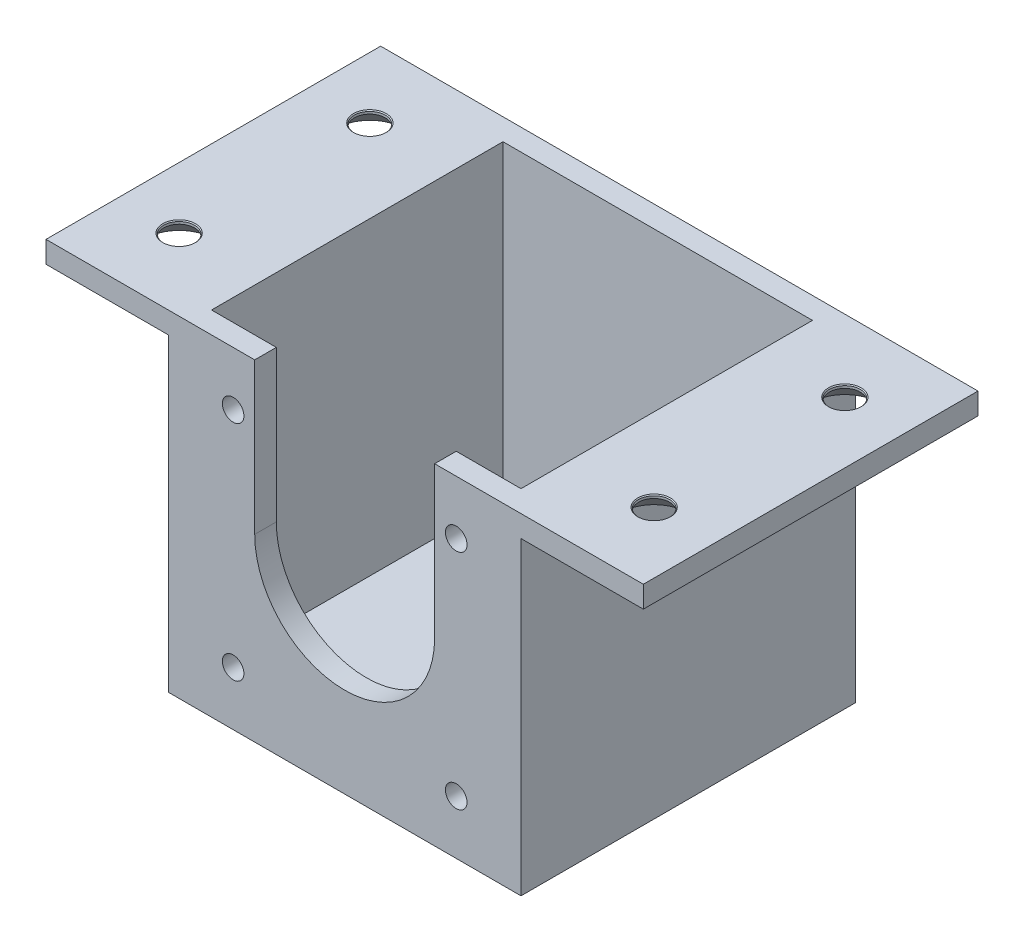
ISO-10303-21;
HEADER;
FILE_DESCRIPTION(('STEP AP214'),'2;1');
FILE_NAME('part.step','',(''),(''),'','','');
FILE_SCHEMA(('AUTOMOTIVE_DESIGN { 1 0 10303 214 1 1 1 1 }'));
ENDSEC;
DATA;
#1=APPLICATION_CONTEXT('core data for automotive mechanical design processes');
#2=APPLICATION_PROTOCOL_DEFINITION('international standard','automotive_design',2000,#1);
#3=PRODUCT_CONTEXT('',#1,'mechanical');
#4=PRODUCT('Part','Part','',(#3));
#5=PRODUCT_RELATED_PRODUCT_CATEGORY('part','',(#4));
#6=PRODUCT_DEFINITION_FORMATION('','',#4);
#7=PRODUCT_DEFINITION_CONTEXT('part definition',#1,'design');
#8=PRODUCT_DEFINITION('design','',#6,#7);
#9=PRODUCT_DEFINITION_SHAPE('','',#8);
#10=(LENGTH_UNIT() NAMED_UNIT(*) SI_UNIT(.MILLI.,.METRE.));
#11=(NAMED_UNIT(*) PLANE_ANGLE_UNIT() SI_UNIT($,.RADIAN.));
#12=(NAMED_UNIT(*) SI_UNIT($,.STERADIAN.) SOLID_ANGLE_UNIT());
#13=UNCERTAINTY_MEASURE_WITH_UNIT(LENGTH_MEASURE(1.E-05),#10,'distance_accuracy_value','');
#14=(GEOMETRIC_REPRESENTATION_CONTEXT(3) GLOBAL_UNCERTAINTY_ASSIGNED_CONTEXT((#13)) GLOBAL_UNIT_ASSIGNED_CONTEXT((#10,
#11,#12)) REPRESENTATION_CONTEXT('',''));
#15=CARTESIAN_POINT('',(0.,0.,0.));
#16=DIRECTION('',(0.,0.,1.));
#17=DIRECTION('',(1.,0.,0.));
#18=AXIS2_PLACEMENT_3D('',#15,#16,#17);
#19=CARTESIAN_POINT('',(-43.,40.,46.5));
#20=DIRECTION('',(0.,1.,0.));
#21=DIRECTION('',(0.,0.,1.));
#22=AXIS2_PLACEMENT_3D('',#19,#20,#21);
#23=PLANE('',#22);
#24=CARTESIAN_POINT('',(-54.5,40.,10.));
#25=DIRECTION('',(0.,-1.,0.));
#26=DIRECTION('',(0.,0.,-1.));
#27=AXIS2_PLACEMENT_3D('',#24,#25,#26);
#28=CIRCLE('',#27,4.7);
#29=CARTESIAN_POINT('',(-54.5,40.,5.3));
#30=VERTEX_POINT('',#29);
#31=EDGE_CURVE('E243',#30,#30,#28,.T.);
#32=ORIENTED_EDGE('',*,*,#31,.F.);
#33=EDGE_LOOP('',(#32));
#34=FACE_BOUND('',#33,.T.);
#35=DIRECTION('',(1.,0.,0.));
#36=VECTOR('',#35,1.);
#37=CARTESIAN_POINT('',(-43.,40.,0.));
#38=LINE('',#37,#36);
#39=CARTESIAN_POINT('',(-63.,40.,0.));
#40=VERTEX_POINT('',#39);
#41=CARTESIAN_POINT('',(-46.,40.,0.));
#42=VERTEX_POINT('',#41);
#43=EDGE_CURVE('E370',#40,#42,#38,.T.);
#44=ORIENTED_EDGE('',*,*,#43,.T.);
#45=DIRECTION('',(0.,0.,-1.));
#46=VECTOR('',#45,1.);
#47=CARTESIAN_POINT('',(-46.,40.,46.5));
#48=LINE('',#47,#46);
#49=CARTESIAN_POINT('',(-46.,40.,46.5));
#50=VERTEX_POINT('',#49);
#51=EDGE_CURVE('E386',#50,#42,#48,.T.);
#52=ORIENTED_EDGE('',*,*,#51,.F.);
#53=DIRECTION('',(1.,0.,0.));
#54=VECTOR('',#53,1.);
#55=CARTESIAN_POINT('',(-43.,40.,46.5));
#56=LINE('',#55,#54);
#57=CARTESIAN_POINT('',(-63.,40.,46.5));
#58=VERTEX_POINT('',#57);
#59=EDGE_CURVE('E351',#58,#50,#56,.T.);
#60=ORIENTED_EDGE('',*,*,#59,.F.);
#61=DIRECTION('',(0.,0.,-1.));
#62=VECTOR('',#61,1.);
#63=CARTESIAN_POINT('',(-63.,40.,46.5));
#64=LINE('',#63,#62);
#65=EDGE_CURVE('E389',#58,#40,#64,.T.);
#66=ORIENTED_EDGE('',*,*,#65,.T.);
#67=EDGE_LOOP('',(#44,#52,#60,#66));
#68=FACE_BOUND('',#67,.T.);
#69=CARTESIAN_POINT('',(-54.5,40.,36.5));
#70=DIRECTION('',(0.,-1.,0.));
#71=DIRECTION('',(0.,0.,-1.));
#72=AXIS2_PLACEMENT_3D('',#69,#70,#71);
#73=CIRCLE('',#72,4.7);
#74=CARTESIAN_POINT('',(-54.5,40.,31.8));
#75=VERTEX_POINT('',#74);
#76=EDGE_CURVE('E255',#75,#75,#73,.T.);
#77=ORIENTED_EDGE('',*,*,#76,.F.);
#78=EDGE_LOOP('',(#77));
#79=FACE_BOUND('',#78,.T.);
#80=ADVANCED_FACE('F35',(#34,#68,#79),#23,.F.);
#81=CARTESIAN_POINT('',(0.,0.,46.5));
#82=DIRECTION('',(-1.,0.,0.));
#83=DIRECTION('',(0.,0.,1.));
#84=AXIS2_PLACEMENT_3D('',#81,#82,#83);
#85=PLANE('',#84);
#86=DIRECTION('',(0.,0.,-1.));
#87=VECTOR('',#86,1.);
#88=CARTESIAN_POINT('',(0.,0.,46.5));
#89=LINE('',#88,#87);
#90=CARTESIAN_POINT('',(0.,0.,43.5));
#91=VERTEX_POINT('',#90);
#92=CARTESIAN_POINT('',(0.,0.,3.));
#93=VERTEX_POINT('',#92);
#94=EDGE_CURVE('E397',#91,#93,#89,.T.);
#95=ORIENTED_EDGE('',*,*,#94,.F.);
#96=DIRECTION('',(0.,-1.,0.));
#97=VECTOR('',#96,1.);
#98=CARTESIAN_POINT('',(0.,43.,43.5));
#99=LINE('',#98,#97);
#100=CARTESIAN_POINT('',(0.,43.,43.5));
#101=VERTEX_POINT('',#100);
#102=EDGE_CURVE('E316',#101,#91,#99,.T.);
#103=ORIENTED_EDGE('',*,*,#102,.F.);
#104=DIRECTION('',(0.,0.,-1.));
#105=VECTOR('',#104,1.);
#106=CARTESIAN_POINT('',(0.,43.,46.5));
#107=LINE('',#106,#105);
#108=CARTESIAN_POINT('',(0.,43.,3.));
#109=VERTEX_POINT('',#108);
#110=EDGE_CURVE('E400',#101,#109,#107,.T.);
#111=ORIENTED_EDGE('',*,*,#110,.T.);
#112=DIRECTION('',(0.,-1.,0.));
#113=VECTOR('',#112,1.);
#114=CARTESIAN_POINT('',(0.,43.,3.));
#115=LINE('',#114,#113);
#116=EDGE_CURVE('E328',#109,#93,#115,.T.);
#117=ORIENTED_EDGE('',*,*,#116,.T.);
#118=EDGE_LOOP('',(#95,#103,#111,#117));
#119=FACE_BOUND('',#118,.T.);
#120=ADVANCED_FACE('F471',(#119),#85,.T.);
#121=CARTESIAN_POINT('',(0.,0.,46.5));
#122=DIRECTION('',(0.,1.,0.));
#123=DIRECTION('',(-1.,0.,0.));
#124=AXIS2_PLACEMENT_3D('',#121,#122,#123);
#125=PLANE('',#124);
#126=DIRECTION('',(0.,0.,-1.));
#127=VECTOR('',#126,1.);
#128=CARTESIAN_POINT('',(-8.99999999999999,0.,46.5));
#129=LINE('',#128,#127);
#130=CARTESIAN_POINT('',(-8.99999999999999,0.,15.));
#131=VERTEX_POINT('',#130);
#132=CARTESIAN_POINT('',(-9.,0.,3.));
#133=VERTEX_POINT('',#132);
#134=EDGE_CURVE('E204',#131,#133,#129,.T.);
#135=ORIENTED_EDGE('',*,*,#134,.F.);
#136=DIRECTION('',(1.,0.,0.));
#137=VECTOR('',#136,1.);
#138=CARTESIAN_POINT('',(0.,0.,15.));
#139=LINE('',#138,#137);
#140=CARTESIAN_POINT('',(-34.,0.,15.));
#141=VERTEX_POINT('',#140);
#142=EDGE_CURVE('E214',#141,#131,#139,.T.);
#143=ORIENTED_EDGE('',*,*,#142,.F.);
#144=DIRECTION('',(0.,0.,1.));
#145=VECTOR('',#144,1.);
#146=CARTESIAN_POINT('',(-34.,0.,46.5));
#147=LINE('',#146,#145);
#148=CARTESIAN_POINT('',(-34.,0.,3.));
#149=VERTEX_POINT('',#148);
#150=EDGE_CURVE('E202',#149,#141,#147,.T.);
#151=ORIENTED_EDGE('',*,*,#150,.F.);
#152=DIRECTION('',(1.,0.,0.));
#153=VECTOR('',#152,1.);
#154=CARTESIAN_POINT('',(-43.,0.,3.));
#155=LINE('',#154,#153);
#156=CARTESIAN_POINT('',(-43.,0.,3.));
#157=VERTEX_POINT('',#156);
#158=EDGE_CURVE('E329',#157,#149,#155,.T.);
#159=ORIENTED_EDGE('',*,*,#158,.F.);
#160=DIRECTION('',(0.,0.,-1.));
#161=VECTOR('',#160,1.);
#162=CARTESIAN_POINT('',(-43.,0.,46.5));
#163=LINE('',#162,#161);
#164=CARTESIAN_POINT('',(-43.,0.,43.5));
#165=VERTEX_POINT('',#164);
#166=EDGE_CURVE('E395',#165,#157,#163,.T.);
#167=ORIENTED_EDGE('',*,*,#166,.F.);
#168=DIRECTION('',(-1.,0.,0.));
#169=VECTOR('',#168,1.);
#170=CARTESIAN_POINT('',(-43.,0.,43.5));
#171=LINE('',#170,#169);
#172=EDGE_CURVE('E312',#91,#165,#171,.T.);
#173=ORIENTED_EDGE('',*,*,#172,.F.);
#174=ORIENTED_EDGE('',*,*,#94,.T.);
#175=EDGE_CURVE('E324',#133,#93,#155,.T.);
#176=ORIENTED_EDGE('',*,*,#175,.F.);
#177=EDGE_LOOP('',(#135,#143,#151,#159,#167,#173,#174,#176));
#178=FACE_BOUND('',#177,.T.);
#179=ADVANCED_FACE('F418',(#178),#125,.T.);
#180=CARTESIAN_POINT('',(-43.,0.,46.5));
#181=DIRECTION('',(1.,0.,0.));
#182=DIRECTION('',(0.,0.,-1.));
#183=AXIS2_PLACEMENT_3D('',#180,#181,#182);
#184=PLANE('',#183);
#185=DIRECTION('',(0.,0.,-1.));
#186=VECTOR('',#185,1.);
#187=CARTESIAN_POINT('',(-43.,43.,46.5));
#188=LINE('',#187,#186);
#189=CARTESIAN_POINT('',(-43.,43.,43.5));
#190=VERTEX_POINT('',#189);
#191=CARTESIAN_POINT('',(-43.,43.,3.));
#192=VERTEX_POINT('',#191);
#193=EDGE_CURVE('E393',#190,#192,#188,.T.);
#194=ORIENTED_EDGE('',*,*,#193,.F.);
#195=DIRECTION('',(0.,-1.,0.));
#196=VECTOR('',#195,1.);
#197=CARTESIAN_POINT('',(-43.,43.,43.5));
#198=LINE('',#197,#196);
#199=EDGE_CURVE('E322',#190,#165,#198,.T.);
#200=ORIENTED_EDGE('',*,*,#199,.T.);
#201=ORIENTED_EDGE('',*,*,#166,.T.);
#202=DIRECTION('',(0.,-1.,0.));
#203=VECTOR('',#202,1.);
#204=CARTESIAN_POINT('',(-43.,43.,3.));
#205=LINE('',#204,#203);
#206=EDGE_CURVE('E334',#192,#157,#205,.T.);
#207=ORIENTED_EDGE('',*,*,#206,.F.);
#208=EDGE_LOOP('',(#194,#200,#201,#207));
#209=FACE_BOUND('',#208,.T.);
#210=ADVANCED_FACE('F548',(#209),#184,.T.);
#211=CARTESIAN_POINT('',(0.,40.,46.5));
#212=DIRECTION('',(0.,1.,0.));
#213=DIRECTION('',(-1.,0.,0.));
#214=AXIS2_PLACEMENT_3D('',#211,#212,#213);
#215=PLANE('',#214);
#216=CARTESIAN_POINT('',(11.5,40.,10.));
#217=DIRECTION('',(0.,-1.,0.));
#218=DIRECTION('',(0.,0.,-1.));
#219=AXIS2_PLACEMENT_3D('',#216,#217,#218);
#220=CIRCLE('',#219,4.7);
#221=CARTESIAN_POINT('',(11.5,40.,5.3));
#222=VERTEX_POINT('',#221);
#223=EDGE_CURVE('E219',#222,#222,#220,.T.);
#224=ORIENTED_EDGE('',*,*,#223,.F.);
#225=EDGE_LOOP('',(#224));
#226=FACE_BOUND('',#225,.T.);
#227=CARTESIAN_POINT('',(11.5,40.,36.5));
#228=DIRECTION('',(0.,-1.,0.));
#229=DIRECTION('',(0.,0.,-1.));
#230=AXIS2_PLACEMENT_3D('',#227,#228,#229);
#231=CIRCLE('',#230,4.7);
#232=CARTESIAN_POINT('',(11.5,40.,31.8));
#233=VERTEX_POINT('',#232);
#234=EDGE_CURVE('E231',#233,#233,#231,.T.);
#235=ORIENTED_EDGE('',*,*,#234,.F.);
#236=EDGE_LOOP('',(#235));
#237=FACE_BOUND('',#236,.T.);
#238=DIRECTION('',(1.,0.,0.));
#239=VECTOR('',#238,1.);
#240=CARTESIAN_POINT('',(0.,40.,0.));
#241=LINE('',#240,#239);
#242=CARTESIAN_POINT('',(3.,40.,0.));
#243=VERTEX_POINT('',#242);
#244=CARTESIAN_POINT('',(20.,40.,0.));
#245=VERTEX_POINT('',#244);
#246=EDGE_CURVE('E337',#243,#245,#241,.T.);
#247=ORIENTED_EDGE('',*,*,#246,.T.);
#248=DIRECTION('',(0.,0.,-1.));
#249=VECTOR('',#248,1.);
#250=CARTESIAN_POINT('',(20.,40.,46.5));
#251=LINE('',#250,#249);
#252=CARTESIAN_POINT('',(20.,40.,46.5));
#253=VERTEX_POINT('',#252);
#254=EDGE_CURVE('E405',#253,#245,#251,.T.);
#255=ORIENTED_EDGE('',*,*,#254,.F.);
#256=DIRECTION('',(1.,0.,0.));
#257=VECTOR('',#256,1.);
#258=CARTESIAN_POINT('',(0.,40.,46.5));
#259=LINE('',#258,#257);
#260=CARTESIAN_POINT('',(3.,40.,46.5));
#261=VERTEX_POINT('',#260);
#262=EDGE_CURVE('E338',#261,#253,#259,.T.);
#263=ORIENTED_EDGE('',*,*,#262,.F.);
#264=DIRECTION('',(0.,0.,-1.));
#265=VECTOR('',#264,1.);
#266=CARTESIAN_POINT('',(3.,40.,46.5));
#267=LINE('',#266,#265);
#268=EDGE_CURVE('E359',#261,#243,#267,.T.);
#269=ORIENTED_EDGE('',*,*,#268,.T.);
#270=EDGE_LOOP('',(#247,#255,#263,#269));
#271=FACE_BOUND('',#270,.T.);
#272=ADVANCED_FACE('F37',(#226,#237,#271),#215,.F.);
#273=CARTESIAN_POINT('',(20.,43.,46.5));
#274=DIRECTION('',(1.,0.,0.));
#275=DIRECTION('',(0.,0.,-1.));
#276=AXIS2_PLACEMENT_3D('',#273,#274,#275);
#277=PLANE('',#276);
#278=DIRECTION('',(0.,-1.,0.));
#279=VECTOR('',#278,1.);
#280=CARTESIAN_POINT('',(20.,43.,0.));
#281=LINE('',#280,#279);
#282=CARTESIAN_POINT('',(20.,43.,0.));
#283=VERTEX_POINT('',#282);
#284=EDGE_CURVE('E362',#283,#245,#281,.T.);
#285=ORIENTED_EDGE('',*,*,#284,.F.);
#286=DIRECTION('',(0.,0.,-1.));
#287=VECTOR('',#286,1.);
#288=CARTESIAN_POINT('',(20.,43.,46.5));
#289=LINE('',#288,#287);
#290=CARTESIAN_POINT('',(20.,43.,46.5));
#291=VERTEX_POINT('',#290);
#292=EDGE_CURVE('E402',#291,#283,#289,.T.);
#293=ORIENTED_EDGE('',*,*,#292,.F.);
#294=DIRECTION('',(0.,-1.,0.));
#295=VECTOR('',#294,1.);
#296=CARTESIAN_POINT('',(20.,43.,46.5));
#297=LINE('',#296,#295);
#298=EDGE_CURVE('E340',#291,#253,#297,.T.);
#299=ORIENTED_EDGE('',*,*,#298,.T.);
#300=ORIENTED_EDGE('',*,*,#254,.T.);
#301=EDGE_LOOP('',(#285,#293,#299,#300));
#302=FACE_BOUND('',#301,.T.);
#303=ADVANCED_FACE('F457',(#302),#277,.T.);
#304=CARTESIAN_POINT('',(-43.,43.,46.5));
#305=DIRECTION('',(0.,1.,0.));
#306=DIRECTION('',(0.,0.,1.));
#307=AXIS2_PLACEMENT_3D('',#304,#305,#306);
#308=PLANE('',#307);
#309=CARTESIAN_POINT('',(11.5,43.,10.));
#310=DIRECTION('',(0.,-1.,0.));
#311=DIRECTION('',(0.,0.,-1.));
#312=AXIS2_PLACEMENT_3D('',#309,#310,#311);
#313=CIRCLE('',#312,2.275);
#314=CARTESIAN_POINT('',(11.5,43.,7.725));
#315=VERTEX_POINT('',#314);
#316=EDGE_CURVE('E216',#315,#315,#313,.T.);
#317=ORIENTED_EDGE('',*,*,#316,.T.);
#318=EDGE_LOOP('',(#317));
#319=FACE_BOUND('',#318,.T.);
#320=CARTESIAN_POINT('',(11.5,43.,36.5));
#321=DIRECTION('',(0.,-1.,0.));
#322=DIRECTION('',(0.,0.,-1.));
#323=AXIS2_PLACEMENT_3D('',#320,#321,#322);
#324=CIRCLE('',#323,2.275);
#325=CARTESIAN_POINT('',(11.5,43.,34.225));
#326=VERTEX_POINT('',#325);
#327=EDGE_CURVE('E228',#326,#326,#324,.T.);
#328=ORIENTED_EDGE('',*,*,#327,.T.);
#329=EDGE_LOOP('',(#328));
#330=FACE_BOUND('',#329,.T.);
#331=CARTESIAN_POINT('',(-54.5,43.,10.));
#332=DIRECTION('',(0.,-1.,0.));
#333=DIRECTION('',(0.,0.,-1.));
#334=AXIS2_PLACEMENT_3D('',#331,#332,#333);
#335=CIRCLE('',#334,2.275);
#336=CARTESIAN_POINT('',(-54.5,43.,7.725));
#337=VERTEX_POINT('',#336);
#338=EDGE_CURVE('E240',#337,#337,#335,.T.);
#339=ORIENTED_EDGE('',*,*,#338,.T.);
#340=EDGE_LOOP('',(#339));
#341=FACE_BOUND('',#340,.T.);
#342=CARTESIAN_POINT('',(-54.5,43.,36.5));
#343=DIRECTION('',(0.,-1.,0.));
#344=DIRECTION('',(0.,0.,-1.));
#345=AXIS2_PLACEMENT_3D('',#342,#343,#344);
#346=CIRCLE('',#345,2.275);
#347=CARTESIAN_POINT('',(-54.5,43.,34.225));
#348=VERTEX_POINT('',#347);
#349=EDGE_CURVE('E252',#348,#348,#346,.T.);
#350=ORIENTED_EDGE('',*,*,#349,.T.);
#351=EDGE_LOOP('',(#350));
#352=FACE_BOUND('',#351,.T.);
#353=DIRECTION('',(0.,0.,1.));
#354=VECTOR('',#353,1.);
#355=CARTESIAN_POINT('',(-9.,43.,-0.001000000000001));
#356=LINE('',#355,#354);
#357=CARTESIAN_POINT('',(-9.,43.,43.5));
#358=VERTEX_POINT('',#357);
#359=CARTESIAN_POINT('',(-9.,43.,46.5));
#360=VERTEX_POINT('',#359);
#361=EDGE_CURVE('E307',#358,#360,#356,.T.);
#362=ORIENTED_EDGE('',*,*,#361,.T.);
#363=DIRECTION('',(1.,0.,0.));
#364=VECTOR('',#363,1.);
#365=CARTESIAN_POINT('',(0.,43.,46.5));
#366=LINE('',#365,#364);
#367=EDGE_CURVE('E344',#360,#291,#366,.T.);
#368=ORIENTED_EDGE('',*,*,#367,.T.);
#369=ORIENTED_EDGE('',*,*,#292,.T.);
#370=DIRECTION('',(1.,0.,0.));
#371=VECTOR('',#370,1.);
#372=CARTESIAN_POINT('',(-43.,43.,0.));
#373=LINE('',#372,#371);
#374=CARTESIAN_POINT('',(-63.,43.,0.));
#375=VERTEX_POINT('',#374);
#376=EDGE_CURVE('E365',#375,#283,#373,.T.);
#377=ORIENTED_EDGE('',*,*,#376,.F.);
#378=DIRECTION('',(0.,0.,-1.));
#379=VECTOR('',#378,1.);
#380=CARTESIAN_POINT('',(-63.,43.,46.5));
#381=LINE('',#380,#379);
#382=CARTESIAN_POINT('',(-63.,43.,46.5));
#383=VERTEX_POINT('',#382);
#384=EDGE_CURVE('E391',#383,#375,#381,.T.);
#385=ORIENTED_EDGE('',*,*,#384,.F.);
#386=CARTESIAN_POINT('',(-34.,43.,46.5));
#387=VERTEX_POINT('',#386);
#388=EDGE_CURVE('E345',#383,#387,#366,.T.);
#389=ORIENTED_EDGE('',*,*,#388,.T.);
#390=DIRECTION('',(0.,0.,1.));
#391=VECTOR('',#390,1.);
#392=CARTESIAN_POINT('',(-34.,43.,-0.001000000000001));
#393=LINE('',#392,#391);
#394=CARTESIAN_POINT('',(-34.,43.,43.5));
#395=VERTEX_POINT('',#394);
#396=EDGE_CURVE('E304',#395,#387,#393,.T.);
#397=ORIENTED_EDGE('',*,*,#396,.F.);
#398=DIRECTION('',(-1.,0.,0.));
#399=VECTOR('',#398,1.);
#400=CARTESIAN_POINT('',(-43.,43.,43.5));
#401=LINE('',#400,#399);
#402=EDGE_CURVE('E317',#395,#190,#401,.T.);
#403=ORIENTED_EDGE('',*,*,#402,.T.);
#404=ORIENTED_EDGE('',*,*,#193,.T.);
#405=DIRECTION('',(1.,0.,0.));
#406=VECTOR('',#405,1.);
#407=CARTESIAN_POINT('',(-43.,43.,3.));
#408=LINE('',#407,#406);
#409=EDGE_CURVE('E325',#192,#109,#408,.T.);
#410=ORIENTED_EDGE('',*,*,#409,.T.);
#411=ORIENTED_EDGE('',*,*,#110,.F.);
#412=EDGE_CURVE('E313',#101,#358,#401,.T.);
#413=ORIENTED_EDGE('',*,*,#412,.T.);
#414=EDGE_LOOP('',(#362,#368,#369,#377,#385,#389,#397,#403,#404,#410,#411,#413));
#415=FACE_BOUND('',#414,.T.);
#416=ADVANCED_FACE('F452',(#319,#330,#341,#352,#415),#308,.T.);
#417=CARTESIAN_POINT('',(-63.,40.,46.5));
#418=DIRECTION('',(-1.,0.,0.));
#419=DIRECTION('',(0.,0.,1.));
#420=AXIS2_PLACEMENT_3D('',#417,#418,#419);
#421=PLANE('',#420);
#422=DIRECTION('',(0.,1.,0.));
#423=VECTOR('',#422,1.);
#424=CARTESIAN_POINT('',(-63.,40.,0.));
#425=LINE('',#424,#423);
#426=EDGE_CURVE('E367',#40,#375,#425,.T.);
#427=ORIENTED_EDGE('',*,*,#426,.F.);
#428=ORIENTED_EDGE('',*,*,#65,.F.);
#429=DIRECTION('',(0.,1.,0.));
#430=VECTOR('',#429,1.);
#431=CARTESIAN_POINT('',(-63.,40.,46.5));
#432=LINE('',#431,#430);
#433=EDGE_CURVE('E348',#58,#383,#432,.T.);
#434=ORIENTED_EDGE('',*,*,#433,.T.);
#435=ORIENTED_EDGE('',*,*,#384,.T.);
#436=EDGE_LOOP('',(#427,#428,#434,#435));
#437=FACE_BOUND('',#436,.T.);
#438=ADVANCED_FACE('F446',(#437),#421,.T.);
#439=CARTESIAN_POINT('',(-46.,0.,46.5));
#440=DIRECTION('',(1.,0.,0.));
#441=DIRECTION('',(0.,0.,-1.));
#442=AXIS2_PLACEMENT_3D('',#439,#440,#441);
#443=PLANE('',#442);
#444=DIRECTION('',(0.,1.,0.));
#445=VECTOR('',#444,1.);
#446=CARTESIAN_POINT('',(-46.,0.,0.));
#447=LINE('',#446,#445);
#448=CARTESIAN_POINT('',(-46.,-3.00000000000001,0.));
#449=VERTEX_POINT('',#448);
#450=EDGE_CURVE('E372',#42,#449,#447,.F.);
#451=ORIENTED_EDGE('',*,*,#450,.T.);
#452=DIRECTION('',(0.,0.,-1.));
#453=VECTOR('',#452,1.);
#454=CARTESIAN_POINT('',(-46.,-3.00000000000001,46.5));
#455=LINE('',#454,#453);
#456=CARTESIAN_POINT('',(-46.,-3.00000000000001,46.5));
#457=VERTEX_POINT('',#456);
#458=EDGE_CURVE('E383',#457,#449,#455,.T.);
#459=ORIENTED_EDGE('',*,*,#458,.F.);
#460=DIRECTION('',(0.,1.,0.));
#461=VECTOR('',#460,1.);
#462=CARTESIAN_POINT('',(-46.,0.,46.5));
#463=LINE('',#462,#461);
#464=EDGE_CURVE('E353',#50,#457,#463,.F.);
#465=ORIENTED_EDGE('',*,*,#464,.F.);
#466=ORIENTED_EDGE('',*,*,#51,.T.);
#467=EDGE_LOOP('',(#451,#459,#465,#466));
#468=FACE_BOUND('',#467,.T.);
#469=ADVANCED_FACE('F440',(#468),#443,.F.);
#470=CARTESIAN_POINT('',(0.,-3.,46.5));
#471=DIRECTION('',(0.,1.,0.));
#472=DIRECTION('',(-1.,0.,0.));
#473=AXIS2_PLACEMENT_3D('',#470,#471,#472);
#474=PLANE('',#473);
#475=DIRECTION('',(-1.,0.,0.));
#476=VECTOR('',#475,1.);
#477=CARTESIAN_POINT('',(-8.99999999999999,-3.,15.));
#478=LINE('',#477,#476);
#479=CARTESIAN_POINT('',(-8.99999999999999,-3.,15.));
#480=VERTEX_POINT('',#479);
#481=CARTESIAN_POINT('',(-34.,-3.,15.));
#482=VERTEX_POINT('',#481);
#483=EDGE_CURVE('E428',#480,#482,#478,.T.);
#484=ORIENTED_EDGE('',*,*,#483,.F.);
#485=DIRECTION('',(0.,0.,1.));
#486=VECTOR('',#485,1.);
#487=CARTESIAN_POINT('',(-8.99999999999999,-3.,0.));
#488=LINE('',#487,#486);
#489=CARTESIAN_POINT('',(-8.99999999999999,-3.,0.));
#490=VERTEX_POINT('',#489);
#491=EDGE_CURVE('E425',#490,#480,#488,.T.);
#492=ORIENTED_EDGE('',*,*,#491,.F.);
#493=DIRECTION('',(1.,0.,0.));
#494=VECTOR('',#493,1.);
#495=CARTESIAN_POINT('',(0.,-3.,0.));
#496=LINE('',#495,#494);
#497=CARTESIAN_POINT('',(3.,-3.,0.));
#498=VERTEX_POINT('',#497);
#499=EDGE_CURVE('E201',#490,#498,#496,.T.);
#500=ORIENTED_EDGE('',*,*,#499,.T.);
#501=DIRECTION('',(0.,0.,-1.));
#502=VECTOR('',#501,1.);
#503=CARTESIAN_POINT('',(3.,-3.,46.5));
#504=LINE('',#503,#502);
#505=CARTESIAN_POINT('',(3.,-3.,46.5));
#506=VERTEX_POINT('',#505);
#507=EDGE_CURVE('E380',#506,#498,#504,.T.);
#508=ORIENTED_EDGE('',*,*,#507,.F.);
#509=DIRECTION('',(1.,0.,0.));
#510=VECTOR('',#509,1.);
#511=CARTESIAN_POINT('',(0.,-3.,46.5));
#512=LINE('',#511,#510);
#513=EDGE_CURVE('E355',#457,#506,#512,.T.);
#514=ORIENTED_EDGE('',*,*,#513,.F.);
#515=ORIENTED_EDGE('',*,*,#458,.T.);
#516=CARTESIAN_POINT('',(-34.,-3.,0.));
#517=VERTEX_POINT('',#516);
#518=EDGE_CURVE('E374',#449,#517,#496,.T.);
#519=ORIENTED_EDGE('',*,*,#518,.T.);
#520=DIRECTION('',(0.,0.,-1.));
#521=VECTOR('',#520,1.);
#522=CARTESIAN_POINT('',(-34.,-3.,0.));
#523=LINE('',#522,#521);
#524=EDGE_CURVE('E190',#482,#517,#523,.T.);
#525=ORIENTED_EDGE('',*,*,#524,.F.);
#526=EDGE_LOOP('',(#484,#492,#500,#508,#514,#515,#519,#525));
#527=FACE_BOUND('',#526,.T.);
#528=ADVANCED_FACE('F431',(#527),#474,.F.);
#529=CARTESIAN_POINT('',(3.,0.,46.5));
#530=DIRECTION('',(-1.,0.,0.));
#531=DIRECTION('',(0.,0.,1.));
#532=AXIS2_PLACEMENT_3D('',#529,#530,#531);
#533=PLANE('',#532);
#534=DIRECTION('',(0.,1.,0.));
#535=VECTOR('',#534,1.);
#536=CARTESIAN_POINT('',(3.,0.,0.));
#537=LINE('',#536,#535);
#538=EDGE_CURVE('E341',#498,#243,#537,.T.);
#539=ORIENTED_EDGE('',*,*,#538,.T.);
#540=ORIENTED_EDGE('',*,*,#268,.F.);
#541=DIRECTION('',(0.,1.,0.));
#542=VECTOR('',#541,1.);
#543=CARTESIAN_POINT('',(3.,0.,46.5));
#544=LINE('',#543,#542);
#545=EDGE_CURVE('E357',#506,#261,#544,.T.);
#546=ORIENTED_EDGE('',*,*,#545,.F.);
#547=ORIENTED_EDGE('',*,*,#507,.T.);
#548=EDGE_LOOP('',(#539,#540,#546,#547));
#549=FACE_BOUND('',#548,.T.);
#550=ADVANCED_FACE('F465',(#549),#533,.F.);
#551=CARTESIAN_POINT('',(0.,0.,46.5));
#552=DIRECTION('',(0.,0.,-1.));
#553=DIRECTION('',(-1.,0.,0.));
#554=AXIS2_PLACEMENT_3D('',#551,#552,#553);
#555=PLANE('',#554);
#556=CARTESIAN_POINT('',(-6.,4.5,46.5));
#557=DIRECTION('',(0.,0.,1.));
#558=DIRECTION('',(1.,0.,0.));
#559=AXIS2_PLACEMENT_3D('',#556,#557,#558);
#560=CIRCLE('',#559,1.5);
#561=CARTESIAN_POINT('',(-4.5,4.5,46.5));
#562=VERTEX_POINT('',#561);
#563=EDGE_CURVE('E282',#562,#562,#560,.T.);
#564=ORIENTED_EDGE('',*,*,#563,.F.);
#565=EDGE_LOOP('',(#564));
#566=FACE_BOUND('',#565,.T.);
#567=CARTESIAN_POINT('',(-6.,35.5,46.5));
#568=DIRECTION('',(0.,0.,1.));
#569=DIRECTION('',(1.,0.,0.));
#570=AXIS2_PLACEMENT_3D('',#567,#568,#569);
#571=CIRCLE('',#570,1.5);
#572=CARTESIAN_POINT('',(-4.5,35.5,46.5));
#573=VERTEX_POINT('',#572);
#574=EDGE_CURVE('E276',#573,#573,#571,.T.);
#575=ORIENTED_EDGE('',*,*,#574,.F.);
#576=EDGE_LOOP('',(#575));
#577=FACE_BOUND('',#576,.T.);
#578=CARTESIAN_POINT('',(-37.,35.5,46.5));
#579=DIRECTION('',(0.,0.,1.));
#580=DIRECTION('',(1.,0.,0.));
#581=AXIS2_PLACEMENT_3D('',#578,#579,#580);
#582=CIRCLE('',#581,1.5);
#583=CARTESIAN_POINT('',(-35.5,35.5,46.5));
#584=VERTEX_POINT('',#583);
#585=EDGE_CURVE('E269',#584,#584,#582,.T.);
#586=ORIENTED_EDGE('',*,*,#585,.F.);
#587=EDGE_LOOP('',(#586));
#588=FACE_BOUND('',#587,.T.);
#589=CARTESIAN_POINT('',(-37.,4.49999999999999,46.5));
#590=DIRECTION('',(0.,0.,1.));
#591=DIRECTION('',(1.,0.,0.));
#592=AXIS2_PLACEMENT_3D('',#589,#590,#591);
#593=CIRCLE('',#592,1.5);
#594=CARTESIAN_POINT('',(-35.5,4.49999999999999,46.5));
#595=VERTEX_POINT('',#594);
#596=EDGE_CURVE('E268',#595,#595,#593,.T.);
#597=ORIENTED_EDGE('',*,*,#596,.F.);
#598=EDGE_LOOP('',(#597));
#599=FACE_BOUND('',#598,.T.);
#600=ORIENTED_EDGE('',*,*,#367,.F.);
#601=DIRECTION('',(0.,1.,0.));
#602=VECTOR('',#601,1.);
#603=CARTESIAN_POINT('',(-9.,43.,46.5));
#604=LINE('',#603,#602);
#605=CARTESIAN_POINT('',(-9.,22.,46.5));
#606=VERTEX_POINT('',#605);
#607=EDGE_CURVE('E291',#606,#360,#604,.T.);
#608=ORIENTED_EDGE('',*,*,#607,.F.);
#609=CARTESIAN_POINT('',(-21.5,22.,46.5));
#610=DIRECTION('',(0.,0.,1.));
#611=DIRECTION('',(-1.,0.,0.));
#612=AXIS2_PLACEMENT_3D('',#609,#610,#611);
#613=CIRCLE('',#612,12.5);
#614=CARTESIAN_POINT('',(-34.,22.,46.5));
#615=VERTEX_POINT('',#614);
#616=EDGE_CURVE('E294',#615,#606,#613,.T.);
#617=ORIENTED_EDGE('',*,*,#616,.F.);
#618=DIRECTION('',(0.,-1.,0.));
#619=VECTOR('',#618,1.);
#620=CARTESIAN_POINT('',(-34.,43.,46.5));
#621=LINE('',#620,#619);
#622=EDGE_CURVE('E297',#387,#615,#621,.T.);
#623=ORIENTED_EDGE('',*,*,#622,.F.);
#624=ORIENTED_EDGE('',*,*,#388,.F.);
#625=ORIENTED_EDGE('',*,*,#433,.F.);
#626=ORIENTED_EDGE('',*,*,#59,.T.);
#627=ORIENTED_EDGE('',*,*,#464,.T.);
#628=ORIENTED_EDGE('',*,*,#513,.T.);
#629=ORIENTED_EDGE('',*,*,#545,.T.);
#630=ORIENTED_EDGE('',*,*,#262,.T.);
#631=ORIENTED_EDGE('',*,*,#298,.F.);
#632=EDGE_LOOP('',(#600,#608,#617,#623,#624,#625,#626,#627,#628,#629,#630,#631));
#633=FACE_BOUND('',#632,.T.);
#634=ADVANCED_FACE('F468',(#566,#577,#588,#599,#633),#555,.F.);
#635=CARTESIAN_POINT('',(0.,0.,0.));
#636=DIRECTION('',(0.,0.,-1.));
#637=DIRECTION('',(-1.,0.,0.));
#638=AXIS2_PLACEMENT_3D('',#635,#636,#637);
#639=PLANE('',#638);
#640=DIRECTION('',(0.,-1.,0.));
#641=VECTOR('',#640,1.);
#642=CARTESIAN_POINT('',(-8.99999999999999,2.,0.));
#643=LINE('',#642,#641);
#644=CARTESIAN_POINT('',(-8.99999999999999,2.,0.));
#645=VERTEX_POINT('',#644);
#646=EDGE_CURVE('E186',#645,#490,#643,.T.);
#647=ORIENTED_EDGE('',*,*,#646,.F.);
#648=DIRECTION('',(1.,0.,0.));
#649=VECTOR('',#648,1.);
#650=CARTESIAN_POINT('',(-8.99999999999999,2.,0.));
#651=LINE('',#650,#649);
#652=CARTESIAN_POINT('',(-34.,2.,0.));
#653=VERTEX_POINT('',#652);
#654=EDGE_CURVE('E193',#653,#645,#651,.T.);
#655=ORIENTED_EDGE('',*,*,#654,.F.);
#656=DIRECTION('',(0.,-1.,0.));
#657=VECTOR('',#656,1.);
#658=CARTESIAN_POINT('',(-34.,2.,0.));
#659=LINE('',#658,#657);
#660=EDGE_CURVE('E50',#653,#517,#659,.T.);
#661=ORIENTED_EDGE('',*,*,#660,.T.);
#662=ORIENTED_EDGE('',*,*,#518,.F.);
#663=ORIENTED_EDGE('',*,*,#450,.F.);
#664=ORIENTED_EDGE('',*,*,#43,.F.);
#665=ORIENTED_EDGE('',*,*,#426,.T.);
#666=ORIENTED_EDGE('',*,*,#376,.T.);
#667=ORIENTED_EDGE('',*,*,#284,.T.);
#668=ORIENTED_EDGE('',*,*,#246,.F.);
#669=ORIENTED_EDGE('',*,*,#538,.F.);
#670=ORIENTED_EDGE('',*,*,#499,.F.);
#671=EDGE_LOOP('',(#647,#655,#661,#662,#663,#664,#665,#666,#667,#668,#669,#670));
#672=FACE_BOUND('',#671,.T.);
#673=ADVANCED_FACE('F199',(#672),#639,.T.);
#674=CARTESIAN_POINT('',(-43.,43.,3.));
#675=DIRECTION('',(0.,0.,-1.));
#676=DIRECTION('',(-1.,0.,0.));
#677=AXIS2_PLACEMENT_3D('',#674,#675,#676);
#678=PLANE('',#677);
#679=DIRECTION('',(-1.,0.,0.));
#680=VECTOR('',#679,1.);
#681=CARTESIAN_POINT('',(-43.,1.99999999999999,3.));
#682=LINE('',#681,#680);
#683=CARTESIAN_POINT('',(-8.99999999999999,2.,3.));
#684=VERTEX_POINT('',#683);
#685=CARTESIAN_POINT('',(-34.,2.,3.));
#686=VERTEX_POINT('',#685);
#687=EDGE_CURVE('E407',#684,#686,#682,.T.);
#688=ORIENTED_EDGE('',*,*,#687,.F.);
#689=DIRECTION('',(0.,-1.,0.));
#690=VECTOR('',#689,1.);
#691=CARTESIAN_POINT('',(-9.,43.,3.));
#692=LINE('',#691,#690);
#693=EDGE_CURVE('E11',#684,#133,#692,.T.);
#694=ORIENTED_EDGE('',*,*,#693,.T.);
#695=ORIENTED_EDGE('',*,*,#175,.T.);
#696=ORIENTED_EDGE('',*,*,#116,.F.);
#697=ORIENTED_EDGE('',*,*,#409,.F.);
#698=ORIENTED_EDGE('',*,*,#206,.T.);
#699=ORIENTED_EDGE('',*,*,#158,.T.);
#700=DIRECTION('',(0.,1.,0.));
#701=VECTOR('',#700,1.);
#702=CARTESIAN_POINT('',(-34.,43.,3.));
#703=LINE('',#702,#701);
#704=EDGE_CURVE('E43',#149,#686,#703,.T.);
#705=ORIENTED_EDGE('',*,*,#704,.T.);
#706=EDGE_LOOP('',(#688,#694,#695,#696,#697,#698,#699,#705));
#707=FACE_BOUND('',#706,.T.);
#708=ADVANCED_FACE('F410',(#707),#678,.F.);
#709=CARTESIAN_POINT('',(-43.,43.,43.5));
#710=DIRECTION('',(0.,0.,1.));
#711=DIRECTION('',(1.,0.,0.));
#712=AXIS2_PLACEMENT_3D('',#709,#710,#711);
#713=PLANE('',#712);
#714=CARTESIAN_POINT('',(-6.,4.5,43.5));
#715=DIRECTION('',(0.,0.,1.));
#716=DIRECTION('',(1.,0.,0.));
#717=AXIS2_PLACEMENT_3D('',#714,#715,#716);
#718=CIRCLE('',#717,1.5);
#719=CARTESIAN_POINT('',(-4.5,4.5,43.5));
#720=VERTEX_POINT('',#719);
#721=EDGE_CURVE('E264',#720,#720,#718,.F.);
#722=ORIENTED_EDGE('',*,*,#721,.F.);
#723=EDGE_LOOP('',(#722));
#724=FACE_BOUND('',#723,.T.);
#725=CARTESIAN_POINT('',(-6.,35.5,43.5));
#726=DIRECTION('',(0.,0.,1.));
#727=DIRECTION('',(1.,0.,0.));
#728=AXIS2_PLACEMENT_3D('',#725,#726,#727);
#729=CIRCLE('',#728,1.5);
#730=CARTESIAN_POINT('',(-4.5,35.5,43.5));
#731=VERTEX_POINT('',#730);
#732=EDGE_CURVE('E279',#731,#731,#729,.F.);
#733=ORIENTED_EDGE('',*,*,#732,.F.);
#734=EDGE_LOOP('',(#733));
#735=FACE_BOUND('',#734,.T.);
#736=CARTESIAN_POINT('',(-37.,35.5,43.5));
#737=DIRECTION('',(0.,0.,1.));
#738=DIRECTION('',(1.,0.,0.));
#739=AXIS2_PLACEMENT_3D('',#736,#737,#738);
#740=CIRCLE('',#739,1.5);
#741=CARTESIAN_POINT('',(-35.5,35.5,43.5));
#742=VERTEX_POINT('',#741);
#743=EDGE_CURVE('E273',#742,#742,#740,.F.);
#744=ORIENTED_EDGE('',*,*,#743,.F.);
#745=EDGE_LOOP('',(#744));
#746=FACE_BOUND('',#745,.T.);
#747=CARTESIAN_POINT('',(-37.,4.49999999999999,43.5));
#748=DIRECTION('',(0.,0.,1.));
#749=DIRECTION('',(1.,0.,0.));
#750=AXIS2_PLACEMENT_3D('',#747,#748,#749);
#751=CIRCLE('',#750,1.5);
#752=CARTESIAN_POINT('',(-35.5,4.49999999999999,43.5));
#753=VERTEX_POINT('',#752);
#754=EDGE_CURVE('E265',#753,#753,#751,.F.);
#755=ORIENTED_EDGE('',*,*,#754,.F.);
#756=EDGE_LOOP('',(#755));
#757=FACE_BOUND('',#756,.T.);
#758=CARTESIAN_POINT('',(-21.5,22.,43.5));
#759=DIRECTION('',(0.,0.,1.));
#760=DIRECTION('',(1.,0.,0.));
#761=AXIS2_PLACEMENT_3D('',#758,#759,#760);
#762=CIRCLE('',#761,12.5);
#763=CARTESIAN_POINT('',(-9.,22.,43.5));
#764=VERTEX_POINT('',#763);
#765=CARTESIAN_POINT('',(-34.,22.,43.5));
#766=VERTEX_POINT('',#765);
#767=EDGE_CURVE('E272',#764,#766,#762,.F.);
#768=ORIENTED_EDGE('',*,*,#767,.F.);
#769=DIRECTION('',(0.,-1.,0.));
#770=VECTOR('',#769,1.);
#771=CARTESIAN_POINT('',(-9.,43.,43.5));
#772=LINE('',#771,#770);
#773=EDGE_CURVE('E300',#358,#764,#772,.T.);
#774=ORIENTED_EDGE('',*,*,#773,.F.);
#775=ORIENTED_EDGE('',*,*,#412,.F.);
#776=ORIENTED_EDGE('',*,*,#102,.T.);
#777=ORIENTED_EDGE('',*,*,#172,.T.);
#778=ORIENTED_EDGE('',*,*,#199,.F.);
#779=ORIENTED_EDGE('',*,*,#402,.F.);
#780=DIRECTION('',(0.,1.,0.));
#781=VECTOR('',#780,1.);
#782=CARTESIAN_POINT('',(-34.,43.,43.5));
#783=LINE('',#782,#781);
#784=EDGE_CURVE('E290',#766,#395,#783,.T.);
#785=ORIENTED_EDGE('',*,*,#784,.F.);
#786=EDGE_LOOP('',(#768,#774,#775,#776,#777,#778,#779,#785));
#787=FACE_BOUND('',#786,.T.);
#788=ADVANCED_FACE('F525',(#724,#735,#746,#757,#787),#713,.F.);
#789=CARTESIAN_POINT('',(-21.5,22.,-0.001000000000001));
#790=DIRECTION('',(0.,0.,1.));
#791=DIRECTION('',(1.,0.,0.));
#792=AXIS2_PLACEMENT_3D('',#789,#790,#791);
#793=CYLINDRICAL_SURFACE('',#792,12.5);
#794=ORIENTED_EDGE('',*,*,#767,.T.);
#795=DIRECTION('',(0.,0.,1.));
#796=VECTOR('',#795,1.);
#797=CARTESIAN_POINT('',(-34.,22.,-0.001000000000001));
#798=LINE('',#797,#796);
#799=EDGE_CURVE('E306',#766,#615,#798,.T.);
#800=ORIENTED_EDGE('',*,*,#799,.T.);
#801=ORIENTED_EDGE('',*,*,#616,.T.);
#802=DIRECTION('',(0.,0.,1.));
#803=VECTOR('',#802,1.);
#804=CARTESIAN_POINT('',(-9.,22.,-0.001000000000001));
#805=LINE('',#804,#803);
#806=EDGE_CURVE('E293',#764,#606,#805,.T.);
#807=ORIENTED_EDGE('',*,*,#806,.F.);
#808=EDGE_LOOP('',(#794,#800,#801,#807));
#809=FACE_BOUND('',#808,.T.);
#810=ADVANCED_FACE('F521',(#809),#793,.F.);
#811=CARTESIAN_POINT('',(-9.,43.,-0.001000000000001));
#812=DIRECTION('',(1.,0.,0.));
#813=DIRECTION('',(0.,0.,-1.));
#814=AXIS2_PLACEMENT_3D('',#811,#812,#813);
#815=PLANE('',#814);
#816=ORIENTED_EDGE('',*,*,#773,.T.);
#817=ORIENTED_EDGE('',*,*,#806,.T.);
#818=ORIENTED_EDGE('',*,*,#607,.T.);
#819=ORIENTED_EDGE('',*,*,#361,.F.);
#820=EDGE_LOOP('',(#816,#817,#818,#819));
#821=FACE_BOUND('',#820,.T.);
#822=ADVANCED_FACE('F517',(#821),#815,.F.);
#823=CARTESIAN_POINT('',(-34.,43.,-0.001000000000001));
#824=DIRECTION('',(-1.,0.,0.));
#825=DIRECTION('',(0.,0.,1.));
#826=AXIS2_PLACEMENT_3D('',#823,#824,#825);
#827=PLANE('',#826);
#828=ORIENTED_EDGE('',*,*,#784,.T.);
#829=ORIENTED_EDGE('',*,*,#396,.T.);
#830=ORIENTED_EDGE('',*,*,#622,.T.);
#831=ORIENTED_EDGE('',*,*,#799,.F.);
#832=EDGE_LOOP('',(#828,#829,#830,#831));
#833=FACE_BOUND('',#832,.T.);
#834=ADVANCED_FACE('F503',(#833),#827,.F.);
#835=CARTESIAN_POINT('',(-37.,4.49999999999999,-0.001000000000001));
#836=DIRECTION('',(0.,0.,1.));
#837=DIRECTION('',(1.,0.,0.));
#838=AXIS2_PLACEMENT_3D('',#835,#836,#837);
#839=CYLINDRICAL_SURFACE('',#838,1.5);
#840=ORIENTED_EDGE('',*,*,#596,.T.);
#841=EDGE_LOOP('',(#840));
#842=FACE_BOUND('',#841,.T.);
#843=ORIENTED_EDGE('',*,*,#754,.T.);
#844=EDGE_LOOP('',(#843));
#845=FACE_BOUND('',#844,.T.);
#846=ADVANCED_FACE('F499',(#842,#845),#839,.F.);
#847=CARTESIAN_POINT('',(-37.,35.5,-0.001000000000001));
#848=DIRECTION('',(0.,0.,1.));
#849=DIRECTION('',(1.,0.,0.));
#850=AXIS2_PLACEMENT_3D('',#847,#848,#849);
#851=CYLINDRICAL_SURFACE('',#850,1.5);
#852=ORIENTED_EDGE('',*,*,#585,.T.);
#853=EDGE_LOOP('',(#852));
#854=FACE_BOUND('',#853,.T.);
#855=ORIENTED_EDGE('',*,*,#743,.T.);
#856=EDGE_LOOP('',(#855));
#857=FACE_BOUND('',#856,.T.);
#858=ADVANCED_FACE('F502',(#854,#857),#851,.F.);
#859=CARTESIAN_POINT('',(-6.,35.5,-0.001000000000001));
#860=DIRECTION('',(0.,0.,1.));
#861=DIRECTION('',(1.,0.,0.));
#862=AXIS2_PLACEMENT_3D('',#859,#860,#861);
#863=CYLINDRICAL_SURFACE('',#862,1.5);
#864=ORIENTED_EDGE('',*,*,#574,.T.);
#865=EDGE_LOOP('',(#864));
#866=FACE_BOUND('',#865,.T.);
#867=ORIENTED_EDGE('',*,*,#732,.T.);
#868=EDGE_LOOP('',(#867));
#869=FACE_BOUND('',#868,.T.);
#870=ADVANCED_FACE('F507',(#866,#869),#863,.F.);
#871=CARTESIAN_POINT('',(-6.,4.5,-0.001000000000001));
#872=DIRECTION('',(0.,0.,1.));
#873=DIRECTION('',(1.,0.,0.));
#874=AXIS2_PLACEMENT_3D('',#871,#872,#873);
#875=CYLINDRICAL_SURFACE('',#874,1.5);
#876=ORIENTED_EDGE('',*,*,#563,.T.);
#877=EDGE_LOOP('',(#876));
#878=FACE_BOUND('',#877,.T.);
#879=ORIENTED_EDGE('',*,*,#721,.T.);
#880=EDGE_LOOP('',(#879));
#881=FACE_BOUND('',#880,.T.);
#882=ADVANCED_FACE('F497',(#878,#881),#875,.F.);
#883=CARTESIAN_POINT('',(-54.5,42.875,36.5));
#884=DIRECTION('',(0.,1.,0.));
#885=DIRECTION('',(0.,0.,1.));
#886=AXIS2_PLACEMENT_3D('',#883,#884,#885);
#887=CONICAL_SURFACE('',#886,2.15,0.785398163397448);
#888=ORIENTED_EDGE('',*,*,#349,.F.);
#889=EDGE_LOOP('',(#888));
#890=FACE_BOUND('',#889,.T.);
#891=CARTESIAN_POINT('',(-54.5,42.875,36.5));
#892=DIRECTION('',(0.,-1.,0.));
#893=DIRECTION('',(0.,0.,-1.));
#894=AXIS2_PLACEMENT_3D('',#891,#892,#893);
#895=CIRCLE('',#894,2.15);
#896=CARTESIAN_POINT('',(-54.5,42.875,34.35));
#897=VERTEX_POINT('',#896);
#898=EDGE_CURVE('E261',#897,#897,#895,.T.);
#899=ORIENTED_EDGE('',*,*,#898,.T.);
#900=EDGE_LOOP('',(#899));
#901=FACE_BOUND('',#900,.T.);
#902=ADVANCED_FACE('F489',(#890,#901),#887,.F.);
#903=CARTESIAN_POINT('',(-54.5,40.,36.5));
#904=DIRECTION('',(0.,-1.,0.));
#905=DIRECTION('',(0.,0.,-1.));
#906=AXIS2_PLACEMENT_3D('',#903,#904,#905);
#907=CYLINDRICAL_SURFACE('',#906,2.15);
#908=ORIENTED_EDGE('',*,*,#898,.F.);
#909=EDGE_LOOP('',(#908));
#910=FACE_BOUND('',#909,.T.);
#911=CARTESIAN_POINT('',(-54.5,42.55,36.5));
#912=DIRECTION('',(0.,-1.,0.));
#913=DIRECTION('',(0.,0.,-1.));
#914=AXIS2_PLACEMENT_3D('',#911,#912,#913);
#915=CIRCLE('',#914,2.15);
#916=CARTESIAN_POINT('',(-54.5,42.55,34.35));
#917=VERTEX_POINT('',#916);
#918=EDGE_CURVE('E258',#917,#917,#915,.T.);
#919=ORIENTED_EDGE('',*,*,#918,.T.);
#920=EDGE_LOOP('',(#919));
#921=FACE_BOUND('',#920,.T.);
#922=ADVANCED_FACE('F479',(#910,#921),#907,.F.);
#923=CARTESIAN_POINT('',(-54.5,40.,36.5));
#924=DIRECTION('',(0.,-1.,0.));
#925=DIRECTION('',(0.,0.,-1.));
#926=AXIS2_PLACEMENT_3D('',#923,#924,#925);
#927=CONICAL_SURFACE('',#926,4.7,0.785398163397448);
#928=ORIENTED_EDGE('',*,*,#918,.F.);
#929=EDGE_LOOP('',(#928));
#930=FACE_BOUND('',#929,.T.);
#931=ORIENTED_EDGE('',*,*,#76,.T.);
#932=EDGE_LOOP('',(#931));
#933=FACE_BOUND('',#932,.T.);
#934=ADVANCED_FACE('F476',(#930,#933),#927,.F.);
#935=CARTESIAN_POINT('',(-54.5,42.875,10.));
#936=DIRECTION('',(0.,1.,0.));
#937=DIRECTION('',(0.,0.,1.));
#938=AXIS2_PLACEMENT_3D('',#935,#936,#937);
#939=CONICAL_SURFACE('',#938,2.15,0.785398163397448);
#940=ORIENTED_EDGE('',*,*,#338,.F.);
#941=EDGE_LOOP('',(#940));
#942=FACE_BOUND('',#941,.T.);
#943=CARTESIAN_POINT('',(-54.5,42.875,10.));
#944=DIRECTION('',(0.,-1.,0.));
#945=DIRECTION('',(0.,0.,-1.));
#946=AXIS2_PLACEMENT_3D('',#943,#944,#945);
#947=CIRCLE('',#946,2.15);
#948=CARTESIAN_POINT('',(-54.5,42.875,7.85));
#949=VERTEX_POINT('',#948);
#950=EDGE_CURVE('E249',#949,#949,#947,.T.);
#951=ORIENTED_EDGE('',*,*,#950,.T.);
#952=EDGE_LOOP('',(#951));
#953=FACE_BOUND('',#952,.T.);
#954=ADVANCED_FACE('F478',(#942,#953),#939,.F.);
#955=CARTESIAN_POINT('',(-54.5,40.,10.));
#956=DIRECTION('',(0.,-1.,0.));
#957=DIRECTION('',(0.,0.,-1.));
#958=AXIS2_PLACEMENT_3D('',#955,#956,#957);
#959=CYLINDRICAL_SURFACE('',#958,2.15);
#960=ORIENTED_EDGE('',*,*,#950,.F.);
#961=EDGE_LOOP('',(#960));
#962=FACE_BOUND('',#961,.T.);
#963=CARTESIAN_POINT('',(-54.5,42.55,10.));
#964=DIRECTION('',(0.,-1.,0.));
#965=DIRECTION('',(0.,0.,-1.));
#966=AXIS2_PLACEMENT_3D('',#963,#964,#965);
#967=CIRCLE('',#966,2.15);
#968=CARTESIAN_POINT('',(-54.5,42.55,7.85));
#969=VERTEX_POINT('',#968);
#970=EDGE_CURVE('E246',#969,#969,#967,.T.);
#971=ORIENTED_EDGE('',*,*,#970,.T.);
#972=EDGE_LOOP('',(#971));
#973=FACE_BOUND('',#972,.T.);
#974=ADVANCED_FACE('F486',(#962,#973),#959,.F.);
#975=CARTESIAN_POINT('',(-54.5,40.,10.));
#976=DIRECTION('',(0.,-1.,0.));
#977=DIRECTION('',(0.,0.,-1.));
#978=AXIS2_PLACEMENT_3D('',#975,#976,#977);
#979=CONICAL_SURFACE('',#978,4.7,0.785398163397448);
#980=ORIENTED_EDGE('',*,*,#970,.F.);
#981=EDGE_LOOP('',(#980));
#982=FACE_BOUND('',#981,.T.);
#983=ORIENTED_EDGE('',*,*,#31,.T.);
#984=EDGE_LOOP('',(#983));
#985=FACE_BOUND('',#984,.T.);
#986=ADVANCED_FACE('F588',(#982,#985),#979,.F.);
#987=CARTESIAN_POINT('',(11.5,42.875,36.5));
#988=DIRECTION('',(0.,1.,0.));
#989=DIRECTION('',(0.,0.,1.));
#990=AXIS2_PLACEMENT_3D('',#987,#988,#989);
#991=CONICAL_SURFACE('',#990,2.15,0.785398163397448);
#992=ORIENTED_EDGE('',*,*,#327,.F.);
#993=EDGE_LOOP('',(#992));
#994=FACE_BOUND('',#993,.T.);
#995=CARTESIAN_POINT('',(11.5,42.875,36.5));
#996=DIRECTION('',(0.,-1.,0.));
#997=DIRECTION('',(0.,0.,-1.));
#998=AXIS2_PLACEMENT_3D('',#995,#996,#997);
#999=CIRCLE('',#998,2.15);
#1000=CARTESIAN_POINT('',(11.5,42.875,34.35));
#1001=VERTEX_POINT('',#1000);
#1002=EDGE_CURVE('E237',#1001,#1001,#999,.T.);
#1003=ORIENTED_EDGE('',*,*,#1002,.T.);
#1004=EDGE_LOOP('',(#1003));
#1005=FACE_BOUND('',#1004,.T.);
#1006=ADVANCED_FACE('F580',(#994,#1005),#991,.F.);
#1007=CARTESIAN_POINT('',(11.5,40.,36.5));
#1008=DIRECTION('',(0.,-1.,0.));
#1009=DIRECTION('',(0.,0.,-1.));
#1010=AXIS2_PLACEMENT_3D('',#1007,#1008,#1009);
#1011=CYLINDRICAL_SURFACE('',#1010,2.15);
#1012=ORIENTED_EDGE('',*,*,#1002,.F.);
#1013=EDGE_LOOP('',(#1012));
#1014=FACE_BOUND('',#1013,.T.);
#1015=CARTESIAN_POINT('',(11.5,42.55,36.5));
#1016=DIRECTION('',(0.,-1.,0.));
#1017=DIRECTION('',(0.,0.,-1.));
#1018=AXIS2_PLACEMENT_3D('',#1015,#1016,#1017);
#1019=CIRCLE('',#1018,2.15);
#1020=CARTESIAN_POINT('',(11.5,42.55,34.35));
#1021=VERTEX_POINT('',#1020);
#1022=EDGE_CURVE('E234',#1021,#1021,#1019,.T.);
#1023=ORIENTED_EDGE('',*,*,#1022,.T.);
#1024=EDGE_LOOP('',(#1023));
#1025=FACE_BOUND('',#1024,.T.);
#1026=ADVANCED_FACE('F570',(#1014,#1025),#1011,.F.);
#1027=CARTESIAN_POINT('',(11.5,40.,36.5));
#1028=DIRECTION('',(0.,-1.,0.));
#1029=DIRECTION('',(0.,0.,-1.));
#1030=AXIS2_PLACEMENT_3D('',#1027,#1028,#1029);
#1031=CONICAL_SURFACE('',#1030,4.7,0.785398163397448);
#1032=ORIENTED_EDGE('',*,*,#1022,.F.);
#1033=EDGE_LOOP('',(#1032));
#1034=FACE_BOUND('',#1033,.T.);
#1035=ORIENTED_EDGE('',*,*,#234,.T.);
#1036=EDGE_LOOP('',(#1035));
#1037=FACE_BOUND('',#1036,.T.);
#1038=ADVANCED_FACE('F567',(#1034,#1037),#1031,.F.);
#1039=CARTESIAN_POINT('',(11.5,42.875,10.));
#1040=DIRECTION('',(0.,1.,0.));
#1041=DIRECTION('',(0.,0.,1.));
#1042=AXIS2_PLACEMENT_3D('',#1039,#1040,#1041);
#1043=CONICAL_SURFACE('',#1042,2.15,0.785398163397448);
#1044=ORIENTED_EDGE('',*,*,#316,.F.);
#1045=EDGE_LOOP('',(#1044));
#1046=FACE_BOUND('',#1045,.T.);
#1047=CARTESIAN_POINT('',(11.5,42.875,10.));
#1048=DIRECTION('',(0.,-1.,0.));
#1049=DIRECTION('',(0.,0.,-1.));
#1050=AXIS2_PLACEMENT_3D('',#1047,#1048,#1049);
#1051=CIRCLE('',#1050,2.15);
#1052=CARTESIAN_POINT('',(11.5,42.875,7.85));
#1053=VERTEX_POINT('',#1052);
#1054=EDGE_CURVE('E225',#1053,#1053,#1051,.T.);
#1055=ORIENTED_EDGE('',*,*,#1054,.T.);
#1056=EDGE_LOOP('',(#1055));
#1057=FACE_BOUND('',#1056,.T.);
#1058=ADVANCED_FACE('F569',(#1046,#1057),#1043,.F.);
#1059=CARTESIAN_POINT('',(11.5,40.,10.));
#1060=DIRECTION('',(0.,-1.,0.));
#1061=DIRECTION('',(0.,0.,-1.));
#1062=AXIS2_PLACEMENT_3D('',#1059,#1060,#1061);
#1063=CYLINDRICAL_SURFACE('',#1062,2.15);
#1064=ORIENTED_EDGE('',*,*,#1054,.F.);
#1065=EDGE_LOOP('',(#1064));
#1066=FACE_BOUND('',#1065,.T.);
#1067=CARTESIAN_POINT('',(11.5,42.55,10.));
#1068=DIRECTION('',(0.,-1.,0.));
#1069=DIRECTION('',(0.,0.,-1.));
#1070=AXIS2_PLACEMENT_3D('',#1067,#1068,#1069);
#1071=CIRCLE('',#1070,2.15);
#1072=CARTESIAN_POINT('',(11.5,42.55,7.85));
#1073=VERTEX_POINT('',#1072);
#1074=EDGE_CURVE('E222',#1073,#1073,#1071,.T.);
#1075=ORIENTED_EDGE('',*,*,#1074,.T.);
#1076=EDGE_LOOP('',(#1075));
#1077=FACE_BOUND('',#1076,.T.);
#1078=ADVANCED_FACE('F577',(#1066,#1077),#1063,.F.);
#1079=CARTESIAN_POINT('',(11.5,40.,10.));
#1080=DIRECTION('',(0.,-1.,0.));
#1081=DIRECTION('',(0.,0.,-1.));
#1082=AXIS2_PLACEMENT_3D('',#1079,#1080,#1081);
#1083=CONICAL_SURFACE('',#1082,4.7,0.785398163397448);
#1084=ORIENTED_EDGE('',*,*,#1074,.F.);
#1085=EDGE_LOOP('',(#1084));
#1086=FACE_BOUND('',#1085,.T.);
#1087=ORIENTED_EDGE('',*,*,#223,.T.);
#1088=EDGE_LOOP('',(#1087));
#1089=FACE_BOUND('',#1088,.T.);
#1090=ADVANCED_FACE('F635',(#1086,#1089),#1083,.F.);
#1091=CARTESIAN_POINT('',(0.,2.,0.));
#1092=DIRECTION('',(0.,-1.,0.));
#1093=DIRECTION('',(1.,0.,0.));
#1094=AXIS2_PLACEMENT_3D('',#1091,#1092,#1093);
#1095=PLANE('',#1094);
#1096=ORIENTED_EDGE('',*,*,#687,.T.);
#1097=DIRECTION('',(0.,0.,-1.));
#1098=VECTOR('',#1097,1.);
#1099=CARTESIAN_POINT('',(-34.,2.,0.));
#1100=LINE('',#1099,#1098);
#1101=EDGE_CURVE('E189',#686,#653,#1100,.T.);
#1102=ORIENTED_EDGE('',*,*,#1101,.T.);
#1103=ORIENTED_EDGE('',*,*,#654,.T.);
#1104=DIRECTION('',(0.,0.,1.));
#1105=VECTOR('',#1104,1.);
#1106=CARTESIAN_POINT('',(-8.99999999999999,2.,0.));
#1107=LINE('',#1106,#1105);
#1108=EDGE_CURVE('E58',#645,#684,#1107,.T.);
#1109=ORIENTED_EDGE('',*,*,#1108,.T.);
#1110=EDGE_LOOP('',(#1096,#1102,#1103,#1109));
#1111=FACE_BOUND('',#1110,.T.);
#1112=ADVANCED_FACE('F194',(#1111),#1095,.T.);
#1113=CARTESIAN_POINT('',(-8.99999999999999,2.,0.));
#1114=DIRECTION('',(1.,0.,0.));
#1115=DIRECTION('',(0.,1.,0.));
#1116=AXIS2_PLACEMENT_3D('',#1113,#1114,#1115);
#1117=PLANE('',#1116);
#1118=ORIENTED_EDGE('',*,*,#134,.T.);
#1119=ORIENTED_EDGE('',*,*,#693,.F.);
#1120=ORIENTED_EDGE('',*,*,#1108,.F.);
#1121=ORIENTED_EDGE('',*,*,#646,.T.);
#1122=ORIENTED_EDGE('',*,*,#491,.T.);
#1123=DIRECTION('',(0.,-1.,0.));
#1124=VECTOR('',#1123,1.);
#1125=CARTESIAN_POINT('',(-8.99999999999999,2.,15.));
#1126=LINE('',#1125,#1124);
#1127=EDGE_CURVE('E196',#131,#480,#1126,.T.);
#1128=ORIENTED_EDGE('',*,*,#1127,.F.);
#1129=EDGE_LOOP('',(#1118,#1119,#1120,#1121,#1122,#1128));
#1130=FACE_BOUND('',#1129,.T.);
#1131=ADVANCED_FACE('F183',(#1130),#1117,.F.);
#1132=CARTESIAN_POINT('',(-34.,2.,0.));
#1133=DIRECTION('',(-1.,0.,0.));
#1134=DIRECTION('',(0.,-1.,0.));
#1135=AXIS2_PLACEMENT_3D('',#1132,#1133,#1134);
#1136=PLANE('',#1135);
#1137=ORIENTED_EDGE('',*,*,#150,.T.);
#1138=DIRECTION('',(0.,-1.,0.));
#1139=VECTOR('',#1138,1.);
#1140=CARTESIAN_POINT('',(-34.,2.,15.));
#1141=LINE('',#1140,#1139);
#1142=EDGE_CURVE('E206',#141,#482,#1141,.T.);
#1143=ORIENTED_EDGE('',*,*,#1142,.T.);
#1144=ORIENTED_EDGE('',*,*,#524,.T.);
#1145=ORIENTED_EDGE('',*,*,#660,.F.);
#1146=ORIENTED_EDGE('',*,*,#1101,.F.);
#1147=ORIENTED_EDGE('',*,*,#704,.F.);
#1148=EDGE_LOOP('',(#1137,#1143,#1144,#1145,#1146,#1147));
#1149=FACE_BOUND('',#1148,.T.);
#1150=ADVANCED_FACE('F413',(#1149),#1136,.F.);
#1151=CARTESIAN_POINT('',(-8.99999999999999,2.,15.));
#1152=DIRECTION('',(0.,0.,1.));
#1153=DIRECTION('',(1.,0.,0.));
#1154=AXIS2_PLACEMENT_3D('',#1151,#1152,#1153);
#1155=PLANE('',#1154);
#1156=ORIENTED_EDGE('',*,*,#142,.T.);
#1157=ORIENTED_EDGE('',*,*,#1127,.T.);
#1158=ORIENTED_EDGE('',*,*,#483,.T.);
#1159=ORIENTED_EDGE('',*,*,#1142,.F.);
#1160=EDGE_LOOP('',(#1156,#1157,#1158,#1159));
#1161=FACE_BOUND('',#1160,.T.);
#1162=ADVANCED_FACE('F423',(#1161),#1155,.F.);
#1163=CLOSED_SHELL('',(#80,#120,#179,#210,#272,#303,#416,#438,#469,#528,#550,#634,#673,#708,
#788,#810,#822,#834,#846,#858,#870,#882,#902,#922,#934,#954,#974,#986,#1006,#1026,#1038,#1058,
#1078,#1090,#1112,#1131,#1150,#1162));
#1164=MANIFOLD_SOLID_BREP('B2',#1163);
#1165=ADVANCED_BREP_SHAPE_REPRESENTATION('',(#18,#1164),#14);
#1166=SHAPE_DEFINITION_REPRESENTATION(#9,#1165);
ENDSEC;
END-ISO-10303-21;
